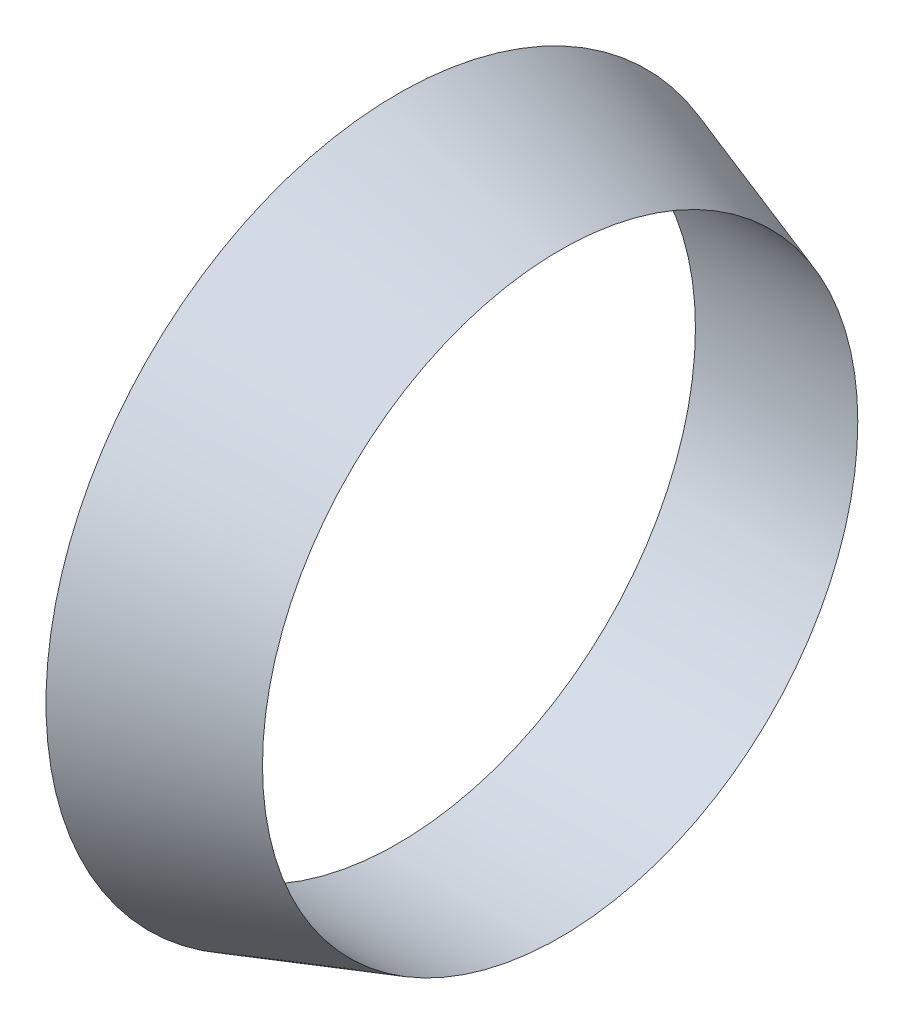
ISO-10303-21;
HEADER;
FILE_DESCRIPTION(('STEP AP214'),'2;1');
FILE_NAME('part.step','',(''),(''),'','','');
FILE_SCHEMA(('AUTOMOTIVE_DESIGN { 1 0 10303 214 1 1 1 1 }'));
ENDSEC;
DATA;
#1=APPLICATION_CONTEXT('core data for automotive mechanical design processes');
#2=APPLICATION_PROTOCOL_DEFINITION('international standard','automotive_design',2000,#1);
#3=PRODUCT_CONTEXT('',#1,'mechanical');
#4=PRODUCT('Part','Part','',(#3));
#5=PRODUCT_RELATED_PRODUCT_CATEGORY('part','',(#4));
#6=PRODUCT_DEFINITION_FORMATION('','',#4);
#7=PRODUCT_DEFINITION_CONTEXT('part definition',#1,'design');
#8=PRODUCT_DEFINITION('design','',#6,#7);
#9=PRODUCT_DEFINITION_SHAPE('','',#8);
#10=(LENGTH_UNIT() NAMED_UNIT(*) SI_UNIT(.MILLI.,.METRE.));
#11=(NAMED_UNIT(*) PLANE_ANGLE_UNIT() SI_UNIT($,.RADIAN.));
#12=(NAMED_UNIT(*) SI_UNIT($,.STERADIAN.) SOLID_ANGLE_UNIT());
#13=UNCERTAINTY_MEASURE_WITH_UNIT(LENGTH_MEASURE(1.E-05),#10,'distance_accuracy_value','');
#14=(GEOMETRIC_REPRESENTATION_CONTEXT(3) GLOBAL_UNCERTAINTY_ASSIGNED_CONTEXT((#13)) GLOBAL_UNIT_ASSIGNED_CONTEXT((#10,
#11,#12)) REPRESENTATION_CONTEXT('',''));
#15=CARTESIAN_POINT('',(0.,0.,0.));
#16=DIRECTION('',(0.,0.,1.));
#17=DIRECTION('',(1.,0.,0.));
#18=AXIS2_PLACEMENT_3D('',#15,#16,#17);
#19=CARTESIAN_POINT('',(0.,0.,0.));
#20=DIRECTION('',(1.,0.,0.));
#21=DIRECTION('',(0.,0.,-1.));
#22=AXIS2_PLACEMENT_3D('',#19,#20,#21);
#23=PLANE('',#22);
#24=CARTESIAN_POINT('',(0.,0.,0.));
#25=DIRECTION('',(1.,0.,0.));
#26=DIRECTION('',(0.,0.,-1.));
#27=AXIS2_PLACEMENT_3D('',#24,#25,#26);
#28=CIRCLE('',#27,55.);
#29=CARTESIAN_POINT('',(0.,0.,-55.));
#30=VERTEX_POINT('',#29);
#31=EDGE_CURVE('E51',#30,#30,#28,.T.);
#32=ORIENTED_EDGE('',*,*,#31,.T.);
#33=EDGE_LOOP('',(#32));
#34=FACE_BOUND('',#33,.T.);
#35=CARTESIAN_POINT('',(0.,0.,0.));
#36=DIRECTION('',(1.,0.,0.));
#37=DIRECTION('',(0.,0.,-1.));
#38=AXIS2_PLACEMENT_3D('',#35,#36,#37);
#39=CIRCLE('',#38,65.);
#40=CARTESIAN_POINT('',(0.,0.,-65.));
#41=VERTEX_POINT('',#40);
#42=EDGE_CURVE('E11',#41,#41,#39,.T.);
#43=ORIENTED_EDGE('',*,*,#42,.F.);
#44=EDGE_LOOP('',(#43));
#45=FACE_BOUND('',#44,.T.);
#46=ADVANCED_FACE('F41',(#34,#45),#23,.F.);
#47=CARTESIAN_POINT('',(30.,0.,0.));
#48=DIRECTION('',(-1.,0.,0.));
#49=DIRECTION('',(0.,0.,1.));
#50=AXIS2_PLACEMENT_3D('',#47,#48,#49);
#51=CONICAL_SURFACE('',#50,55.,0.321750554396642);
#52=ORIENTED_EDGE('',*,*,#42,.T.);
#53=EDGE_LOOP('',(#52));
#54=FACE_BOUND('',#53,.T.);
#55=CARTESIAN_POINT('',(30.,0.,0.));
#56=DIRECTION('',(1.,0.,0.));
#57=DIRECTION('',(0.,0.,-1.));
#58=AXIS2_PLACEMENT_3D('',#55,#56,#57);
#59=CIRCLE('',#58,55.);
#60=CARTESIAN_POINT('',(30.,0.,-55.));
#61=VERTEX_POINT('',#60);
#62=EDGE_CURVE('E58',#61,#61,#59,.T.);
#63=ORIENTED_EDGE('',*,*,#62,.F.);
#64=EDGE_LOOP('',(#63));
#65=FACE_BOUND('',#64,.T.);
#66=ADVANCED_FACE('F43',(#54,#65),#51,.T.);
#67=CARTESIAN_POINT('',(-9.99999999994061E-05,0.,0.));
#68=DIRECTION('',(1.,0.,0.));
#69=DIRECTION('',(0.,0.,-1.));
#70=AXIS2_PLACEMENT_3D('',#67,#68,#69);
#71=CYLINDRICAL_SURFACE('',#70,55.);
#72=ORIENTED_EDGE('',*,*,#62,.T.);
#73=EDGE_LOOP('',(#72));
#74=FACE_BOUND('',#73,.T.);
#75=ORIENTED_EDGE('',*,*,#31,.F.);
#76=EDGE_LOOP('',(#75));
#77=FACE_BOUND('',#76,.T.);
#78=ADVANCED_FACE('F74',(#74,#77),#71,.F.);
#79=CLOSED_SHELL('',(#46,#66,#78));
#80=MANIFOLD_SOLID_BREP('B2',#79);
#81=ADVANCED_BREP_SHAPE_REPRESENTATION('',(#18,#80),#14);
#82=SHAPE_DEFINITION_REPRESENTATION(#9,#81);
ENDSEC;
END-ISO-10303-21;
